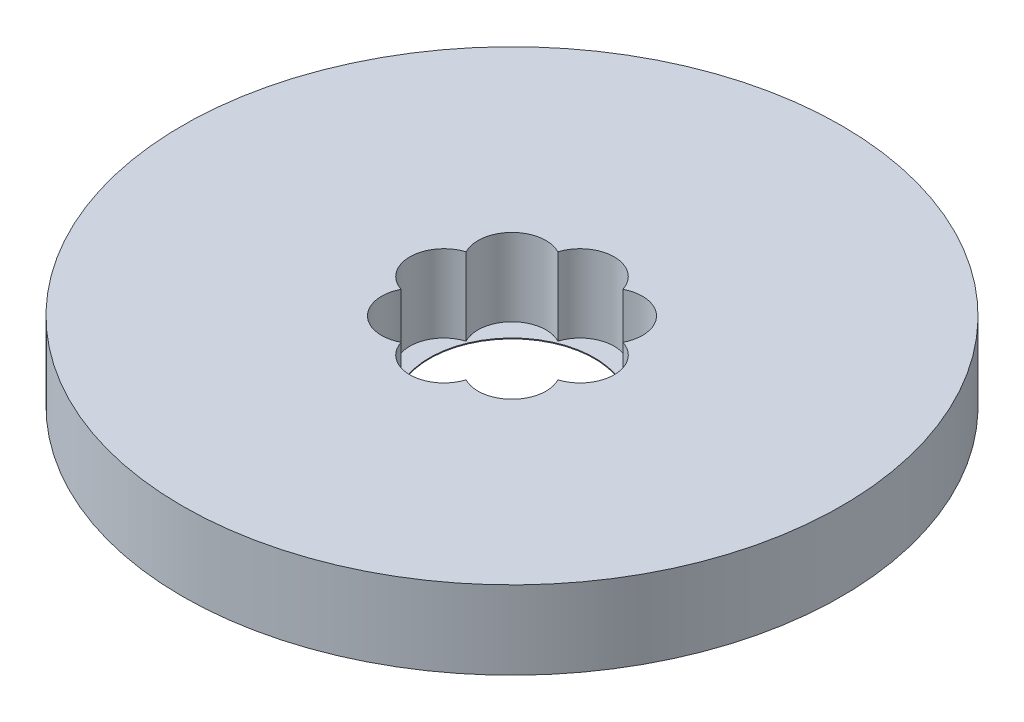
ISO-10303-21;
HEADER;
FILE_DESCRIPTION(('STEP AP214'),'2;1');
FILE_NAME('part.step','',(''),(''),'','','');
FILE_SCHEMA(('AUTOMOTIVE_DESIGN { 1 0 10303 214 1 1 1 1 }'));
ENDSEC;
DATA;
#1=APPLICATION_CONTEXT('core data for automotive mechanical design processes');
#2=APPLICATION_PROTOCOL_DEFINITION('international standard','automotive_design',2000,#1);
#3=PRODUCT_CONTEXT('',#1,'mechanical');
#4=PRODUCT('Part','Part','',(#3));
#5=PRODUCT_RELATED_PRODUCT_CATEGORY('part','',(#4));
#6=PRODUCT_DEFINITION_FORMATION('','',#4);
#7=PRODUCT_DEFINITION_CONTEXT('part definition',#1,'design');
#8=PRODUCT_DEFINITION('design','',#6,#7);
#9=PRODUCT_DEFINITION_SHAPE('','',#8);
#10=(LENGTH_UNIT() NAMED_UNIT(*) SI_UNIT(.MILLI.,.METRE.));
#11=(NAMED_UNIT(*) PLANE_ANGLE_UNIT() SI_UNIT($,.RADIAN.));
#12=(NAMED_UNIT(*) SI_UNIT($,.STERADIAN.) SOLID_ANGLE_UNIT());
#13=UNCERTAINTY_MEASURE_WITH_UNIT(LENGTH_MEASURE(1.E-05),#10,'distance_accuracy_value','');
#14=(GEOMETRIC_REPRESENTATION_CONTEXT(3) GLOBAL_UNCERTAINTY_ASSIGNED_CONTEXT((#13)) GLOBAL_UNIT_ASSIGNED_CONTEXT((#10,
#11,#12)) REPRESENTATION_CONTEXT('',''));
#15=CARTESIAN_POINT('',(0.,0.,0.));
#16=DIRECTION('',(0.,0.,1.));
#17=DIRECTION('',(1.,0.,0.));
#18=AXIS2_PLACEMENT_3D('',#15,#16,#17);
#19=CARTESIAN_POINT('',(0.,19.,0.));
#20=DIRECTION('',(0.,-1.,0.));
#21=DIRECTION('',(0.,0.,-1.));
#22=AXIS2_PLACEMENT_3D('',#19,#20,#21);
#23=CYLINDRICAL_SURFACE('',#22,20.);
#24=CARTESIAN_POINT('',(0.,0.,0.));
#25=DIRECTION('',(0.,1.,0.));
#26=DIRECTION('',(0.,0.,1.));
#27=AXIS2_PLACEMENT_3D('',#24,#25,#26);
#28=CIRCLE('',#27,20.);
#29=CARTESIAN_POINT('',(0.,0.,20.));
#30=VERTEX_POINT('',#29);
#31=EDGE_CURVE('E166',#30,#30,#28,.T.);
#32=ORIENTED_EDGE('',*,*,#31,.F.);
#33=EDGE_LOOP('',(#32));
#34=FACE_BOUND('',#33,.T.);
#35=CARTESIAN_POINT('',(0.,0.209609427443885,0.));
#36=DIRECTION('',(0.,1.,0.));
#37=DIRECTION('',(0.,0.,1.));
#38=AXIS2_PLACEMENT_3D('',#35,#36,#37);
#39=CIRCLE('',#38,20.);
#40=CARTESIAN_POINT('',(0.,0.209609427443885,20.));
#41=VERTEX_POINT('',#40);
#42=EDGE_CURVE('E11',#41,#41,#39,.T.);
#43=ORIENTED_EDGE('',*,*,#42,.T.);
#44=EDGE_LOOP('',(#43));
#45=FACE_BOUND('',#44,.T.);
#46=ADVANCED_FACE('F39',(#34,#45),#23,.F.);
#47=CARTESIAN_POINT('',(0.,19.,0.));
#48=DIRECTION('',(0.,-1.,0.));
#49=DIRECTION('',(0.,0.,-1.));
#50=AXIS2_PLACEMENT_3D('',#47,#48,#49);
#51=CYLINDRICAL_SURFACE('',#50,80.);
#52=CARTESIAN_POINT('',(0.,19.,0.));
#53=DIRECTION('',(0.,1.,0.));
#54=DIRECTION('',(0.,0.,1.));
#55=AXIS2_PLACEMENT_3D('',#52,#53,#54);
#56=CIRCLE('',#55,80.);
#57=CARTESIAN_POINT('',(0.,19.,80.));
#58=VERTEX_POINT('',#57);
#59=EDGE_CURVE('E50',#58,#58,#56,.T.);
#60=ORIENTED_EDGE('',*,*,#59,.F.);
#61=EDGE_LOOP('',(#60));
#62=FACE_BOUND('',#61,.T.);
#63=CARTESIAN_POINT('',(0.,0.,0.));
#64=DIRECTION('',(0.,1.,0.));
#65=DIRECTION('',(0.,0.,1.));
#66=AXIS2_PLACEMENT_3D('',#63,#64,#65);
#67=CIRCLE('',#66,80.);
#68=CARTESIAN_POINT('',(0.,0.,80.));
#69=VERTEX_POINT('',#68);
#70=EDGE_CURVE('E173',#69,#69,#67,.T.);
#71=ORIENTED_EDGE('',*,*,#70,.T.);
#72=EDGE_LOOP('',(#71));
#73=FACE_BOUND('',#72,.T.);
#74=ADVANCED_FACE('F41',(#62,#73),#51,.T.);
#75=CARTESIAN_POINT('',(0.,19.,0.));
#76=DIRECTION('',(0.,1.,0.));
#77=DIRECTION('',(0.,0.,1.));
#78=AXIS2_PLACEMENT_3D('',#75,#76,#77);
#79=PLANE('',#78);
#80=CARTESIAN_POINT('',(-11.6930682525755,19.,11.6930682525756));
#81=DIRECTION('',(0.,1.,0.));
#82=DIRECTION('',(0.707106781186549,0.,0.707106781186546));
#83=AXIS2_PLACEMENT_3D('',#80,#81,#82);
#84=CIRCLE('',#83,8.2712305211612);
#85=CARTESIAN_POINT('',(-19.0353920960466,19.,7.88471757127215));
#86=VERTEX_POINT('',#85);
#87=CARTESIAN_POINT('',(-7.88471757127209,19.,19.0353920960467));
#88=VERTEX_POINT('',#87);
#89=EDGE_CURVE('E159',#86,#88,#84,.T.);
#90=ORIENTED_EDGE('',*,*,#89,.F.);
#91=CARTESIAN_POINT('',(-16.5364957085466,19.,0.));
#92=DIRECTION('',(0.,1.,0.));
#93=DIRECTION('',(0.,0.,1.));
#94=AXIS2_PLACEMENT_3D('',#91,#92,#93);
#95=CIRCLE('',#94,8.2712305211612);
#96=CARTESIAN_POINT('',(-19.0353920960469,19.,-7.88471757127209));
#97=VERTEX_POINT('',#96);
#98=EDGE_CURVE('E167',#97,#86,#95,.T.);
#99=ORIENTED_EDGE('',*,*,#98,.F.);
#100=CARTESIAN_POINT('',(-11.6930682525757,19.,-11.6930682525754));
#101=DIRECTION('',(0.,1.,0.));
#102=DIRECTION('',(-0.707106781186539,0.,0.707106781186556));
#103=AXIS2_PLACEMENT_3D('',#100,#101,#102);
#104=CIRCLE('',#103,8.2712305211612);
#105=CARTESIAN_POINT('',(-7.88471757127235,19.,-19.0353920960466));
#106=VERTEX_POINT('',#105);
#107=EDGE_CURVE('E53',#106,#97,#104,.T.);
#108=ORIENTED_EDGE('',*,*,#107,.F.);
#109=CARTESIAN_POINT('',(-1.7321059852875E-13,19.,-16.5364957085466));
#110=DIRECTION('',(0.,1.,0.));
#111=DIRECTION('',(-1.,0.,0.));
#112=AXIS2_PLACEMENT_3D('',#109,#110,#111);
#113=CIRCLE('',#112,8.2712305211612);
#114=CARTESIAN_POINT('',(7.88471757127196,19.,-19.0353920960467));
#115=VERTEX_POINT('',#114);
#116=EDGE_CURVE('E117',#115,#106,#113,.T.);
#117=ORIENTED_EDGE('',*,*,#116,.F.);
#118=CARTESIAN_POINT('',(11.6930682525754,19.,-11.6930682525757));
#119=DIRECTION('',(0.,1.,0.));
#120=DIRECTION('',(-0.707106781186554,0.,-0.707106781186541));
#121=AXIS2_PLACEMENT_3D('',#118,#119,#120);
#122=CIRCLE('',#121,8.2712305211612);
#123=CARTESIAN_POINT('',(19.0353920960465,19.,-7.88471757127219));
#124=VERTEX_POINT('',#123);
#125=EDGE_CURVE('E120',#124,#115,#122,.T.);
#126=ORIENTED_EDGE('',*,*,#125,.F.);
#127=CARTESIAN_POINT('',(16.5364957085466,19.,0.));
#128=DIRECTION('',(0.,1.,0.));
#129=DIRECTION('',(0.,0.,-1.));
#130=AXIS2_PLACEMENT_3D('',#127,#128,#129);
#131=CIRCLE('',#130,8.2712305211612);
#132=CARTESIAN_POINT('',(19.0353920960468,19.,7.88471757127212));
#133=VERTEX_POINT('',#132);
#134=EDGE_CURVE('E136',#133,#124,#131,.T.);
#135=ORIENTED_EDGE('',*,*,#134,.F.);
#136=CARTESIAN_POINT('',(11.6930682525756,19.,11.6930682525755));
#137=DIRECTION('',(0.,1.,0.));
#138=DIRECTION('',(0.707106781186544,0.,-0.707106781186551));
#139=AXIS2_PLACEMENT_3D('',#136,#137,#138);
#140=CIRCLE('',#139,8.2712305211612);
#141=CARTESIAN_POINT('',(7.88471757127222,19.,19.0353920960466));
#142=VERTEX_POINT('',#141);
#143=EDGE_CURVE('E138',#142,#133,#140,.T.);
#144=ORIENTED_EDGE('',*,*,#143,.F.);
#145=CARTESIAN_POINT('',(0.,19.,16.5364957085466));
#146=DIRECTION('',(0.,1.,0.));
#147=DIRECTION('',(1.,0.,0.));
#148=AXIS2_PLACEMENT_3D('',#145,#146,#147);
#149=CIRCLE('',#148,8.2712305211612);
#150=EDGE_CURVE('E146',#88,#142,#149,.T.);
#151=ORIENTED_EDGE('',*,*,#150,.F.);
#152=EDGE_LOOP('',(#90,#99,#108,#117,#126,#135,#144,#151));
#153=FACE_BOUND('',#152,.T.);
#154=ORIENTED_EDGE('',*,*,#59,.T.);
#155=EDGE_LOOP('',(#154));
#156=FACE_BOUND('',#155,.T.);
#157=ADVANCED_FACE('F181',(#153,#156),#79,.T.);
#158=CARTESIAN_POINT('',(0.,0.,0.));
#159=DIRECTION('',(0.,1.,0.));
#160=DIRECTION('',(0.,0.,1.));
#161=AXIS2_PLACEMENT_3D('',#158,#159,#160);
#162=PLANE('',#161);
#163=ORIENTED_EDGE('',*,*,#31,.T.);
#164=EDGE_LOOP('',(#163));
#165=FACE_BOUND('',#164,.T.);
#166=ORIENTED_EDGE('',*,*,#70,.F.);
#167=EDGE_LOOP('',(#166));
#168=FACE_BOUND('',#167,.T.);
#169=ADVANCED_FACE('F179',(#165,#168),#162,.F.);
#170=CARTESIAN_POINT('',(-16.5364957085466,0.209609427443885,0.));
#171=DIRECTION('',(0.,1.,0.));
#172=DIRECTION('',(0.,0.,1.));
#173=AXIS2_PLACEMENT_3D('',#170,#171,#172);
#174=CYLINDRICAL_SURFACE('',#173,8.2712305211612);
#175=ORIENTED_EDGE('',*,*,#98,.T.);
#176=DIRECTION('',(0.,1.,0.));
#177=VECTOR('',#176,1.);
#178=CARTESIAN_POINT('',(-19.0353920960466,9.60480471372194,7.88471757127215));
#179=LINE('',#178,#177);
#180=CARTESIAN_POINT('',(-19.0353920960466,0.209609427443885,7.88471757127215));
#181=VERTEX_POINT('',#180);
#182=EDGE_CURVE('E65',#86,#181,#179,.F.);
#183=ORIENTED_EDGE('',*,*,#182,.T.);
#184=CARTESIAN_POINT('',(-16.5364957085466,0.209609427443885,0.));
#185=DIRECTION('',(0.,1.,0.));
#186=DIRECTION('',(0.,0.,1.));
#187=AXIS2_PLACEMENT_3D('',#184,#185,#186);
#188=CIRCLE('',#187,8.2712305211612);
#189=CARTESIAN_POINT('',(-19.0353920960469,0.209609427443885,-7.88471757127209));
#190=VERTEX_POINT('',#189);
#191=EDGE_CURVE('E170',#190,#181,#188,.T.);
#192=ORIENTED_EDGE('',*,*,#191,.F.);
#193=DIRECTION('',(0.,1.,0.));
#194=VECTOR('',#193,1.);
#195=CARTESIAN_POINT('',(-19.0353920960469,9.60480471372194,-7.88471757127209));
#196=LINE('',#195,#194);
#197=EDGE_CURVE('E124',#190,#97,#196,.T.);
#198=ORIENTED_EDGE('',*,*,#197,.T.);
#199=EDGE_LOOP('',(#175,#183,#192,#198));
#200=FACE_BOUND('',#199,.T.);
#201=ADVANCED_FACE('F185',(#200),#174,.F.);
#202=CARTESIAN_POINT('',(-16.5364957085466,0.209609427443885,0.));
#203=DIRECTION('',(0.,1.,0.));
#204=DIRECTION('',(0.,0.,1.));
#205=AXIS2_PLACEMENT_3D('',#202,#203,#204);
#206=PLANE('',#205);
#207=CARTESIAN_POINT('',(-11.6930682525757,0.209609427443885,-11.6930682525754));
#208=DIRECTION('',(0.,1.,0.));
#209=DIRECTION('',(-0.707106781186539,0.,0.707106781186556));
#210=AXIS2_PLACEMENT_3D('',#207,#208,#209);
#211=CIRCLE('',#210,8.2712305211612);
#212=CARTESIAN_POINT('',(-7.88471757127235,0.209609427443885,-19.0353920960466));
#213=VERTEX_POINT('',#212);
#214=EDGE_CURVE('E112',#213,#190,#211,.T.);
#215=ORIENTED_EDGE('',*,*,#214,.T.);
#216=ORIENTED_EDGE('',*,*,#191,.T.);
#217=CARTESIAN_POINT('',(-11.6930682525755,0.209609427443885,11.6930682525756));
#218=DIRECTION('',(0.,1.,0.));
#219=DIRECTION('',(0.707106781186549,0.,0.707106781186546));
#220=AXIS2_PLACEMENT_3D('',#217,#218,#219);
#221=CIRCLE('',#220,8.2712305211612);
#222=CARTESIAN_POINT('',(-7.88471757127209,0.209609427443885,19.0353920960467));
#223=VERTEX_POINT('',#222);
#224=EDGE_CURVE('E161',#181,#223,#221,.T.);
#225=ORIENTED_EDGE('',*,*,#224,.T.);
#226=CARTESIAN_POINT('',(0.,0.209609427443885,16.5364957085466));
#227=DIRECTION('',(0.,1.,0.));
#228=DIRECTION('',(1.,0.,0.));
#229=AXIS2_PLACEMENT_3D('',#226,#227,#228);
#230=CIRCLE('',#229,8.2712305211612);
#231=CARTESIAN_POINT('',(7.88471757127222,0.209609427443885,19.0353920960466));
#232=VERTEX_POINT('',#231);
#233=EDGE_CURVE('E149',#223,#232,#230,.T.);
#234=ORIENTED_EDGE('',*,*,#233,.T.);
#235=CARTESIAN_POINT('',(11.6930682525756,0.209609427443885,11.6930682525755));
#236=DIRECTION('',(0.,1.,0.));
#237=DIRECTION('',(0.707106781186544,0.,-0.707106781186551));
#238=AXIS2_PLACEMENT_3D('',#235,#236,#237);
#239=CIRCLE('',#238,8.2712305211612);
#240=CARTESIAN_POINT('',(19.0353920960467,0.209609427443885,7.88471757127212));
#241=VERTEX_POINT('',#240);
#242=EDGE_CURVE('E143',#232,#241,#239,.T.);
#243=ORIENTED_EDGE('',*,*,#242,.T.);
#244=CARTESIAN_POINT('',(16.5364957085466,0.209609427443885,0.));
#245=DIRECTION('',(0.,1.,0.));
#246=DIRECTION('',(0.,0.,-1.));
#247=AXIS2_PLACEMENT_3D('',#244,#245,#246);
#248=CIRCLE('',#247,8.2712305211612);
#249=CARTESIAN_POINT('',(19.0353920960465,0.209609427443885,-7.88471757127219));
#250=VERTEX_POINT('',#249);
#251=EDGE_CURVE('E140',#241,#250,#248,.T.);
#252=ORIENTED_EDGE('',*,*,#251,.T.);
#253=CARTESIAN_POINT('',(11.6930682525754,0.209609427443885,-11.6930682525757));
#254=DIRECTION('',(0.,1.,0.));
#255=DIRECTION('',(-0.707106781186554,0.,-0.707106781186541));
#256=AXIS2_PLACEMENT_3D('',#253,#254,#255);
#257=CIRCLE('',#256,8.2712305211612);
#258=CARTESIAN_POINT('',(7.88471757127196,0.209609427443885,-19.0353920960467));
#259=VERTEX_POINT('',#258);
#260=EDGE_CURVE('E111',#250,#259,#257,.T.);
#261=ORIENTED_EDGE('',*,*,#260,.T.);
#262=CARTESIAN_POINT('',(-1.7321059852875E-13,0.209609427443885,-16.5364957085466));
#263=DIRECTION('',(0.,1.,0.));
#264=DIRECTION('',(-1.,0.,0.));
#265=AXIS2_PLACEMENT_3D('',#262,#263,#264);
#266=CIRCLE('',#265,8.2712305211612);
#267=EDGE_CURVE('E104',#259,#213,#266,.T.);
#268=ORIENTED_EDGE('',*,*,#267,.T.);
#269=EDGE_LOOP('',(#215,#216,#225,#234,#243,#252,#261,#268));
#270=FACE_BOUND('',#269,.T.);
#271=ORIENTED_EDGE('',*,*,#42,.F.);
#272=EDGE_LOOP('',(#271));
#273=FACE_BOUND('',#272,.T.);
#274=ADVANCED_FACE('F110',(#270,#273),#206,.T.);
#275=CARTESIAN_POINT('',(-11.6930682525755,0.209609427443885,11.6930682525756));
#276=DIRECTION('',(0.,1.,0.));
#277=DIRECTION('',(0.,0.,1.));
#278=AXIS2_PLACEMENT_3D('',#275,#276,#277);
#279=CYLINDRICAL_SURFACE('',#278,8.2712305211612);
#280=ORIENTED_EDGE('',*,*,#89,.T.);
#281=DIRECTION('',(0.,1.,0.));
#282=VECTOR('',#281,1.);
#283=CARTESIAN_POINT('',(-7.88471757127209,9.60480471372194,19.0353920960467));
#284=LINE('',#283,#282);
#285=EDGE_CURVE('E160',#88,#223,#284,.F.);
#286=ORIENTED_EDGE('',*,*,#285,.T.);
#287=ORIENTED_EDGE('',*,*,#224,.F.);
#288=ORIENTED_EDGE('',*,*,#182,.F.);
#289=EDGE_LOOP('',(#280,#286,#287,#288));
#290=FACE_BOUND('',#289,.T.);
#291=ADVANCED_FACE('F202',(#290),#279,.F.);
#292=CARTESIAN_POINT('',(-11.6930682525757,0.209609427443885,-11.6930682525754));
#293=DIRECTION('',(0.,1.,0.));
#294=DIRECTION('',(0.,0.,1.));
#295=AXIS2_PLACEMENT_3D('',#292,#293,#294);
#296=CYLINDRICAL_SURFACE('',#295,8.2712305211612);
#297=ORIENTED_EDGE('',*,*,#214,.F.);
#298=DIRECTION('',(0.,1.,0.));
#299=VECTOR('',#298,1.);
#300=CARTESIAN_POINT('',(-7.88471757127235,9.60480471372194,-19.0353920960466));
#301=LINE('',#300,#299);
#302=EDGE_CURVE('E119',#106,#213,#301,.F.);
#303=ORIENTED_EDGE('',*,*,#302,.F.);
#304=ORIENTED_EDGE('',*,*,#107,.T.);
#305=ORIENTED_EDGE('',*,*,#197,.F.);
#306=EDGE_LOOP('',(#297,#303,#304,#305));
#307=FACE_BOUND('',#306,.T.);
#308=ADVANCED_FACE('F123',(#307),#296,.F.);
#309=CARTESIAN_POINT('',(0.,0.209609427443885,16.5364957085466));
#310=DIRECTION('',(0.,1.,0.));
#311=DIRECTION('',(0.,0.,1.));
#312=AXIS2_PLACEMENT_3D('',#309,#310,#311);
#313=CYLINDRICAL_SURFACE('',#312,8.2712305211612);
#314=ORIENTED_EDGE('',*,*,#150,.T.);
#315=DIRECTION('',(0.,1.,0.));
#316=VECTOR('',#315,1.);
#317=CARTESIAN_POINT('',(7.88471757127222,9.60480471372194,19.0353920960466));
#318=LINE('',#317,#316);
#319=EDGE_CURVE('E141',#142,#232,#318,.F.);
#320=ORIENTED_EDGE('',*,*,#319,.T.);
#321=ORIENTED_EDGE('',*,*,#233,.F.);
#322=ORIENTED_EDGE('',*,*,#285,.F.);
#323=EDGE_LOOP('',(#314,#320,#321,#322));
#324=FACE_BOUND('',#323,.T.);
#325=ADVANCED_FACE('F208',(#324),#313,.F.);
#326=CARTESIAN_POINT('',(11.6930682525756,0.209609427443885,11.6930682525755));
#327=DIRECTION('',(0.,1.,0.));
#328=DIRECTION('',(0.,0.,1.));
#329=AXIS2_PLACEMENT_3D('',#326,#327,#328);
#330=CYLINDRICAL_SURFACE('',#329,8.2712305211612);
#331=DIRECTION('',(0.,1.,0.));
#332=VECTOR('',#331,1.);
#333=CARTESIAN_POINT('',(19.0353920960467,9.60480471372194,7.88471757127212));
#334=LINE('',#333,#332);
#335=EDGE_CURVE('E151',#133,#241,#334,.F.);
#336=ORIENTED_EDGE('',*,*,#335,.T.);
#337=ORIENTED_EDGE('',*,*,#242,.F.);
#338=ORIENTED_EDGE('',*,*,#319,.F.);
#339=ORIENTED_EDGE('',*,*,#143,.T.);
#340=EDGE_LOOP('',(#336,#337,#338,#339));
#341=FACE_BOUND('',#340,.T.);
#342=ADVANCED_FACE('F211',(#341),#330,.F.);
#343=CARTESIAN_POINT('',(16.5364957085466,0.209609427443885,0.));
#344=DIRECTION('',(0.,1.,0.));
#345=DIRECTION('',(0.,0.,1.));
#346=AXIS2_PLACEMENT_3D('',#343,#344,#345);
#347=CYLINDRICAL_SURFACE('',#346,8.2712305211612);
#348=ORIENTED_EDGE('',*,*,#134,.T.);
#349=DIRECTION('',(0.,1.,0.));
#350=VECTOR('',#349,1.);
#351=CARTESIAN_POINT('',(19.0353920960465,9.60480471372194,-7.88471757127219));
#352=LINE('',#351,#350);
#353=EDGE_CURVE('E131',#124,#250,#352,.F.);
#354=ORIENTED_EDGE('',*,*,#353,.T.);
#355=ORIENTED_EDGE('',*,*,#251,.F.);
#356=ORIENTED_EDGE('',*,*,#335,.F.);
#357=EDGE_LOOP('',(#348,#354,#355,#356));
#358=FACE_BOUND('',#357,.T.);
#359=ADVANCED_FACE('F214',(#358),#347,.F.);
#360=CARTESIAN_POINT('',(11.6930682525754,0.209609427443885,-11.6930682525757));
#361=DIRECTION('',(0.,1.,0.));
#362=DIRECTION('',(0.,0.,1.));
#363=AXIS2_PLACEMENT_3D('',#360,#361,#362);
#364=CYLINDRICAL_SURFACE('',#363,8.2712305211612);
#365=DIRECTION('',(0.,1.,0.));
#366=VECTOR('',#365,1.);
#367=CARTESIAN_POINT('',(7.88471757127196,9.60480471372194,-19.0353920960467));
#368=LINE('',#367,#366);
#369=EDGE_CURVE('E154',#115,#259,#368,.F.);
#370=ORIENTED_EDGE('',*,*,#369,.T.);
#371=ORIENTED_EDGE('',*,*,#260,.F.);
#372=ORIENTED_EDGE('',*,*,#353,.F.);
#373=ORIENTED_EDGE('',*,*,#125,.T.);
#374=EDGE_LOOP('',(#370,#371,#372,#373));
#375=FACE_BOUND('',#374,.T.);
#376=ADVANCED_FACE('F218',(#375),#364,.F.);
#377=CARTESIAN_POINT('',(-1.7321059852875E-13,0.209609427443885,-16.5364957085466));
#378=DIRECTION('',(0.,1.,0.));
#379=DIRECTION('',(0.,0.,1.));
#380=AXIS2_PLACEMENT_3D('',#377,#378,#379);
#381=CYLINDRICAL_SURFACE('',#380,8.2712305211612);
#382=ORIENTED_EDGE('',*,*,#116,.T.);
#383=ORIENTED_EDGE('',*,*,#302,.T.);
#384=ORIENTED_EDGE('',*,*,#267,.F.);
#385=ORIENTED_EDGE('',*,*,#369,.F.);
#386=EDGE_LOOP('',(#382,#383,#384,#385));
#387=FACE_BOUND('',#386,.T.);
#388=ADVANCED_FACE('F121',(#387),#381,.F.);
#389=CLOSED_SHELL('',(#46,#74,#157,#169,#201,#274,#291,#308,#325,#342,#359,#376,#388));
#390=MANIFOLD_SOLID_BREP('B2',#389);
#391=ADVANCED_BREP_SHAPE_REPRESENTATION('',(#18,#390),#14);
#392=SHAPE_DEFINITION_REPRESENTATION(#9,#391);
ENDSEC;
END-ISO-10303-21;
